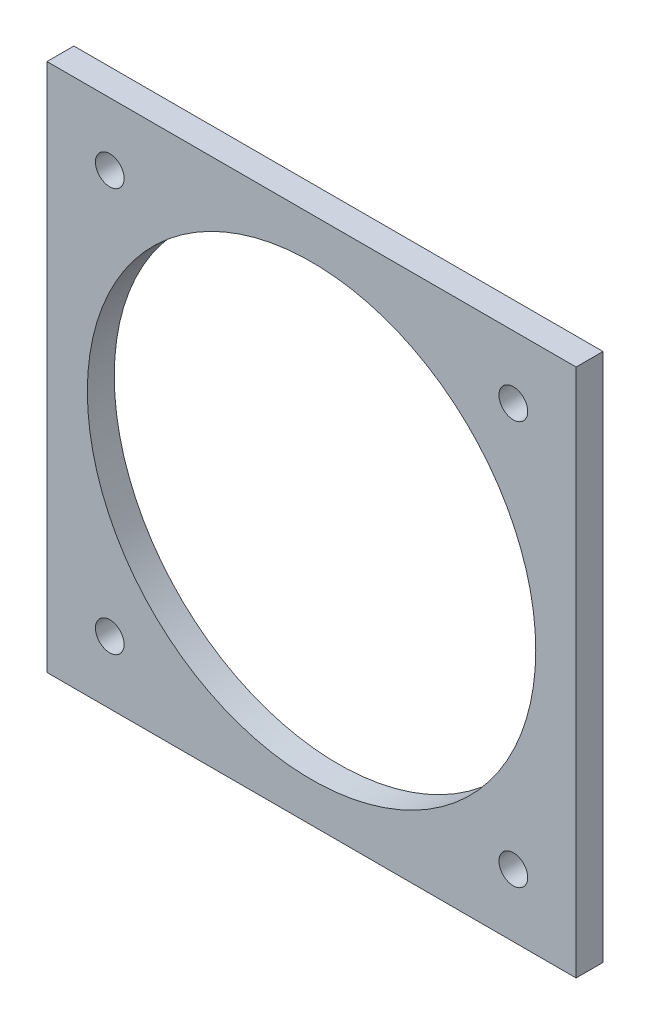
ISO-10303-21;
HEADER;
FILE_DESCRIPTION(('STEP AP214'),'2;1');
FILE_NAME('part.step','',(''),(''),'','','');
FILE_SCHEMA(('AUTOMOTIVE_DESIGN { 1 0 10303 214 1 1 1 1 }'));
ENDSEC;
DATA;
#1=APPLICATION_CONTEXT('core data for automotive mechanical design processes');
#2=APPLICATION_PROTOCOL_DEFINITION('international standard','automotive_design',2000,#1);
#3=PRODUCT_CONTEXT('',#1,'mechanical');
#4=PRODUCT('Part','Part','',(#3));
#5=PRODUCT_RELATED_PRODUCT_CATEGORY('part','',(#4));
#6=PRODUCT_DEFINITION_FORMATION('','',#4);
#7=PRODUCT_DEFINITION_CONTEXT('part definition',#1,'design');
#8=PRODUCT_DEFINITION('design','',#6,#7);
#9=PRODUCT_DEFINITION_SHAPE('','',#8);
#10=(LENGTH_UNIT() NAMED_UNIT(*) SI_UNIT(.MILLI.,.METRE.));
#11=(NAMED_UNIT(*) PLANE_ANGLE_UNIT() SI_UNIT($,.RADIAN.));
#12=(NAMED_UNIT(*) SI_UNIT($,.STERADIAN.) SOLID_ANGLE_UNIT());
#13=UNCERTAINTY_MEASURE_WITH_UNIT(LENGTH_MEASURE(1.E-05),#10,'distance_accuracy_value','');
#14=(GEOMETRIC_REPRESENTATION_CONTEXT(3) GLOBAL_UNCERTAINTY_ASSIGNED_CONTEXT((#13)) GLOBAL_UNIT_ASSIGNED_CONTEXT((#10,
#11,#12)) REPRESENTATION_CONTEXT('',''));
#15=CARTESIAN_POINT('',(0.,0.,0.));
#16=DIRECTION('',(0.,0.,1.));
#17=DIRECTION('',(1.,0.,0.));
#18=AXIS2_PLACEMENT_3D('',#15,#16,#17);
#19=CARTESIAN_POINT('',(0.,0.,3.));
#20=DIRECTION('',(0.,0.,-1.));
#21=DIRECTION('',(-1.,0.,0.));
#22=AXIS2_PLACEMENT_3D('',#19,#20,#21);
#23=PLANE('',#22);
#24=CARTESIAN_POINT('',(7.,7.,3.));
#25=DIRECTION('',(0.,0.,1.));
#26=DIRECTION('',(1.,0.,0.));
#27=AXIS2_PLACEMENT_3D('',#24,#25,#26);
#28=CIRCLE('',#27,1.6);
#29=CARTESIAN_POINT('',(8.6,7.,3.));
#30=VERTEX_POINT('',#29);
#31=EDGE_CURVE('E126',#30,#30,#28,.T.);
#32=ORIENTED_EDGE('',*,*,#31,.F.);
#33=EDGE_LOOP('',(#32));
#34=FACE_BOUND('',#33,.T.);
#35=CARTESIAN_POINT('',(52.,52.,3.));
#36=DIRECTION('',(0.,0.,1.));
#37=DIRECTION('',(1.,0.,0.));
#38=AXIS2_PLACEMENT_3D('',#35,#36,#37);
#39=CIRCLE('',#38,1.6);
#40=CARTESIAN_POINT('',(53.6,52.,3.));
#41=VERTEX_POINT('',#40);
#42=EDGE_CURVE('E114',#41,#41,#39,.T.);
#43=ORIENTED_EDGE('',*,*,#42,.F.);
#44=EDGE_LOOP('',(#43));
#45=FACE_BOUND('',#44,.T.);
#46=DIRECTION('',(0.,-1.,0.));
#47=VECTOR('',#46,1.);
#48=CARTESIAN_POINT('',(0.,0.,3.));
#49=LINE('',#48,#47);
#50=CARTESIAN_POINT('',(0.,59.,3.));
#51=VERTEX_POINT('',#50);
#52=CARTESIAN_POINT('',(0.,0.,3.));
#53=VERTEX_POINT('',#52);
#54=EDGE_CURVE('E84',#51,#53,#49,.T.);
#55=ORIENTED_EDGE('',*,*,#54,.T.);
#56=DIRECTION('',(1.,0.,0.));
#57=VECTOR('',#56,1.);
#58=CARTESIAN_POINT('',(0.,0.,3.));
#59=LINE('',#58,#57);
#60=CARTESIAN_POINT('',(59.,0.,3.));
#61=VERTEX_POINT('',#60);
#62=EDGE_CURVE('E79',#53,#61,#59,.T.);
#63=ORIENTED_EDGE('',*,*,#62,.T.);
#64=DIRECTION('',(0.,1.,0.));
#65=VECTOR('',#64,1.);
#66=CARTESIAN_POINT('',(59.,0.,3.));
#67=LINE('',#66,#65);
#68=CARTESIAN_POINT('',(59.,59.,3.));
#69=VERTEX_POINT('',#68);
#70=EDGE_CURVE('E82',#61,#69,#67,.T.);
#71=ORIENTED_EDGE('',*,*,#70,.T.);
#72=DIRECTION('',(-1.,0.,0.));
#73=VECTOR('',#72,1.);
#74=CARTESIAN_POINT('',(0.,59.,3.));
#75=LINE('',#74,#73);
#76=EDGE_CURVE('E49',#69,#51,#75,.T.);
#77=ORIENTED_EDGE('',*,*,#76,.T.);
#78=EDGE_LOOP('',(#55,#63,#71,#77));
#79=FACE_BOUND('',#78,.T.);
#80=CARTESIAN_POINT('',(7.,52.,3.));
#81=DIRECTION('',(0.,0.,1.));
#82=DIRECTION('',(1.,0.,0.));
#83=AXIS2_PLACEMENT_3D('',#80,#81,#82);
#84=CIRCLE('',#83,1.6);
#85=CARTESIAN_POINT('',(8.6,52.,3.));
#86=VERTEX_POINT('',#85);
#87=EDGE_CURVE('E99',#86,#86,#84,.T.);
#88=ORIENTED_EDGE('',*,*,#87,.F.);
#89=EDGE_LOOP('',(#88));
#90=FACE_BOUND('',#89,.T.);
#91=CARTESIAN_POINT('',(52.,7.,3.));
#92=DIRECTION('',(0.,0.,1.));
#93=DIRECTION('',(1.,0.,0.));
#94=AXIS2_PLACEMENT_3D('',#91,#92,#93);
#95=CIRCLE('',#94,1.6);
#96=CARTESIAN_POINT('',(53.6,7.,3.));
#97=VERTEX_POINT('',#96);
#98=EDGE_CURVE('E120',#97,#97,#95,.T.);
#99=ORIENTED_EDGE('',*,*,#98,.F.);
#100=EDGE_LOOP('',(#99));
#101=FACE_BOUND('',#100,.T.);
#102=CARTESIAN_POINT('',(29.5,29.4,3.));
#103=DIRECTION('',(0.,0.,1.));
#104=DIRECTION('',(1.,0.,0.));
#105=AXIS2_PLACEMENT_3D('',#102,#103,#104);
#106=CIRCLE('',#105,25.);
#107=CARTESIAN_POINT('',(54.5,29.4,3.));
#108=VERTEX_POINT('',#107);
#109=EDGE_CURVE('E132',#108,#108,#106,.T.);
#110=ORIENTED_EDGE('',*,*,#109,.F.);
#111=EDGE_LOOP('',(#110));
#112=FACE_BOUND('',#111,.T.);
#113=ADVANCED_FACE('F32',(#34,#45,#79,#90,#101,#112),#23,.F.);
#114=CARTESIAN_POINT('',(0.,0.,0.));
#115=DIRECTION('',(0.,0.,-1.));
#116=DIRECTION('',(-1.,0.,0.));
#117=AXIS2_PLACEMENT_3D('',#114,#115,#116);
#118=PLANE('',#117);
#119=CARTESIAN_POINT('',(7.,7.,0.));
#120=DIRECTION('',(0.,0.,1.));
#121=DIRECTION('',(1.,0.,0.));
#122=AXIS2_PLACEMENT_3D('',#119,#120,#121);
#123=CIRCLE('',#122,1.6);
#124=CARTESIAN_POINT('',(8.6,7.,0.));
#125=VERTEX_POINT('',#124);
#126=EDGE_CURVE('E129',#125,#125,#123,.T.);
#127=ORIENTED_EDGE('',*,*,#126,.T.);
#128=EDGE_LOOP('',(#127));
#129=FACE_BOUND('',#128,.T.);
#130=CARTESIAN_POINT('',(52.,52.,0.));
#131=DIRECTION('',(0.,0.,1.));
#132=DIRECTION('',(1.,0.,0.));
#133=AXIS2_PLACEMENT_3D('',#130,#131,#132);
#134=CIRCLE('',#133,1.6);
#135=CARTESIAN_POINT('',(53.6,52.,0.));
#136=VERTEX_POINT('',#135);
#137=EDGE_CURVE('E117',#136,#136,#134,.T.);
#138=ORIENTED_EDGE('',*,*,#137,.T.);
#139=EDGE_LOOP('',(#138));
#140=FACE_BOUND('',#139,.T.);
#141=DIRECTION('',(0.,-1.,0.));
#142=VECTOR('',#141,1.);
#143=CARTESIAN_POINT('',(0.,0.,0.));
#144=LINE('',#143,#142);
#145=CARTESIAN_POINT('',(0.,59.,0.));
#146=VERTEX_POINT('',#145);
#147=CARTESIAN_POINT('',(0.,0.,0.));
#148=VERTEX_POINT('',#147);
#149=EDGE_CURVE('E96',#146,#148,#144,.T.);
#150=ORIENTED_EDGE('',*,*,#149,.F.);
#151=DIRECTION('',(-1.,0.,0.));
#152=VECTOR('',#151,1.);
#153=CARTESIAN_POINT('',(0.,59.,0.));
#154=LINE('',#153,#152);
#155=CARTESIAN_POINT('',(59.,59.,0.));
#156=VERTEX_POINT('',#155);
#157=EDGE_CURVE('E72',#156,#146,#154,.T.);
#158=ORIENTED_EDGE('',*,*,#157,.F.);
#159=DIRECTION('',(0.,1.,0.));
#160=VECTOR('',#159,1.);
#161=CARTESIAN_POINT('',(59.,0.,0.));
#162=LINE('',#161,#160);
#163=CARTESIAN_POINT('',(59.,0.,0.));
#164=VERTEX_POINT('',#163);
#165=EDGE_CURVE('E66',#164,#156,#162,.T.);
#166=ORIENTED_EDGE('',*,*,#165,.F.);
#167=DIRECTION('',(1.,0.,0.));
#168=VECTOR('',#167,1.);
#169=CARTESIAN_POINT('',(0.,0.,0.));
#170=LINE('',#169,#168);
#171=EDGE_CURVE('E88',#148,#164,#170,.T.);
#172=ORIENTED_EDGE('',*,*,#171,.F.);
#173=EDGE_LOOP('',(#150,#158,#166,#172));
#174=FACE_BOUND('',#173,.T.);
#175=CARTESIAN_POINT('',(7.,52.,0.));
#176=DIRECTION('',(0.,0.,1.));
#177=DIRECTION('',(1.,0.,0.));
#178=AXIS2_PLACEMENT_3D('',#175,#176,#177);
#179=CIRCLE('',#178,1.6);
#180=CARTESIAN_POINT('',(8.6,52.,0.));
#181=VERTEX_POINT('',#180);
#182=EDGE_CURVE('E111',#181,#181,#179,.T.);
#183=ORIENTED_EDGE('',*,*,#182,.T.);
#184=EDGE_LOOP('',(#183));
#185=FACE_BOUND('',#184,.T.);
#186=CARTESIAN_POINT('',(52.,7.,0.));
#187=DIRECTION('',(0.,0.,1.));
#188=DIRECTION('',(1.,0.,0.));
#189=AXIS2_PLACEMENT_3D('',#186,#187,#188);
#190=CIRCLE('',#189,1.6);
#191=CARTESIAN_POINT('',(53.6,7.,0.));
#192=VERTEX_POINT('',#191);
#193=EDGE_CURVE('E123',#192,#192,#190,.T.);
#194=ORIENTED_EDGE('',*,*,#193,.T.);
#195=EDGE_LOOP('',(#194));
#196=FACE_BOUND('',#195,.T.);
#197=CARTESIAN_POINT('',(29.5,29.4,0.));
#198=DIRECTION('',(0.,0.,1.));
#199=DIRECTION('',(1.,0.,0.));
#200=AXIS2_PLACEMENT_3D('',#197,#198,#199);
#201=CIRCLE('',#200,25.);
#202=CARTESIAN_POINT('',(54.5,29.4,0.));
#203=VERTEX_POINT('',#202);
#204=EDGE_CURVE('E135',#203,#203,#201,.T.);
#205=ORIENTED_EDGE('',*,*,#204,.T.);
#206=EDGE_LOOP('',(#205));
#207=FACE_BOUND('',#206,.T.);
#208=ADVANCED_FACE('F107',(#129,#140,#174,#185,#196,#207),#118,.T.);
#209=CARTESIAN_POINT('',(0.,0.,3.));
#210=DIRECTION('',(1.,0.,0.));
#211=DIRECTION('',(0.,1.,0.));
#212=AXIS2_PLACEMENT_3D('',#209,#210,#211);
#213=PLANE('',#212);
#214=ORIENTED_EDGE('',*,*,#149,.T.);
#215=DIRECTION('',(0.,0.,-1.));
#216=VECTOR('',#215,1.);
#217=CARTESIAN_POINT('',(0.,0.,3.));
#218=LINE('',#217,#216);
#219=EDGE_CURVE('E11',#53,#148,#218,.T.);
#220=ORIENTED_EDGE('',*,*,#219,.F.);
#221=ORIENTED_EDGE('',*,*,#54,.F.);
#222=DIRECTION('',(0.,0.,-1.));
#223=VECTOR('',#222,1.);
#224=CARTESIAN_POINT('',(0.,59.,3.));
#225=LINE('',#224,#223);
#226=EDGE_CURVE('E92',#51,#146,#225,.T.);
#227=ORIENTED_EDGE('',*,*,#226,.T.);
#228=EDGE_LOOP('',(#214,#220,#221,#227));
#229=FACE_BOUND('',#228,.T.);
#230=ADVANCED_FACE('F34',(#229),#213,.F.);
#231=CARTESIAN_POINT('',(0.,0.,3.));
#232=DIRECTION('',(0.,1.,0.));
#233=DIRECTION('',(0.,0.,1.));
#234=AXIS2_PLACEMENT_3D('',#231,#232,#233);
#235=PLANE('',#234);
#236=ORIENTED_EDGE('',*,*,#171,.T.);
#237=DIRECTION('',(0.,0.,-1.));
#238=VECTOR('',#237,1.);
#239=CARTESIAN_POINT('',(59.,0.,3.));
#240=LINE('',#239,#238);
#241=EDGE_CURVE('E41',#61,#164,#240,.T.);
#242=ORIENTED_EDGE('',*,*,#241,.F.);
#243=ORIENTED_EDGE('',*,*,#62,.F.);
#244=ORIENTED_EDGE('',*,*,#219,.T.);
#245=EDGE_LOOP('',(#236,#242,#243,#244));
#246=FACE_BOUND('',#245,.T.);
#247=ADVANCED_FACE('F87',(#246),#235,.F.);
#248=CARTESIAN_POINT('',(59.,0.,3.));
#249=DIRECTION('',(-1.,0.,0.));
#250=DIRECTION('',(0.,-1.,0.));
#251=AXIS2_PLACEMENT_3D('',#248,#249,#250);
#252=PLANE('',#251);
#253=ORIENTED_EDGE('',*,*,#165,.T.);
#254=DIRECTION('',(0.,0.,-1.));
#255=VECTOR('',#254,1.);
#256=CARTESIAN_POINT('',(59.,59.,3.));
#257=LINE('',#256,#255);
#258=EDGE_CURVE('E89',#69,#156,#257,.T.);
#259=ORIENTED_EDGE('',*,*,#258,.F.);
#260=ORIENTED_EDGE('',*,*,#70,.F.);
#261=ORIENTED_EDGE('',*,*,#241,.T.);
#262=EDGE_LOOP('',(#253,#259,#260,#261));
#263=FACE_BOUND('',#262,.T.);
#264=ADVANCED_FACE('F90',(#263),#252,.F.);
#265=CARTESIAN_POINT('',(0.,59.,3.));
#266=DIRECTION('',(0.,-1.,0.));
#267=DIRECTION('',(0.,0.,-1.));
#268=AXIS2_PLACEMENT_3D('',#265,#266,#267);
#269=PLANE('',#268);
#270=ORIENTED_EDGE('',*,*,#157,.T.);
#271=ORIENTED_EDGE('',*,*,#226,.F.);
#272=ORIENTED_EDGE('',*,*,#76,.F.);
#273=ORIENTED_EDGE('',*,*,#258,.T.);
#274=EDGE_LOOP('',(#270,#271,#272,#273));
#275=FACE_BOUND('',#274,.T.);
#276=ADVANCED_FACE('F104',(#275),#269,.F.);
#277=CARTESIAN_POINT('',(7.,52.,3.));
#278=DIRECTION('',(0.,0.,-1.));
#279=DIRECTION('',(-1.,0.,0.));
#280=AXIS2_PLACEMENT_3D('',#277,#278,#279);
#281=CYLINDRICAL_SURFACE('',#280,1.6);
#282=ORIENTED_EDGE('',*,*,#87,.T.);
#283=EDGE_LOOP('',(#282));
#284=FACE_BOUND('',#283,.T.);
#285=ORIENTED_EDGE('',*,*,#182,.F.);
#286=EDGE_LOOP('',(#285));
#287=FACE_BOUND('',#286,.T.);
#288=ADVANCED_FACE('F155',(#284,#287),#281,.F.);
#289=CARTESIAN_POINT('',(52.,52.,3.));
#290=DIRECTION('',(0.,0.,-1.));
#291=DIRECTION('',(-1.,0.,0.));
#292=AXIS2_PLACEMENT_3D('',#289,#290,#291);
#293=CYLINDRICAL_SURFACE('',#292,1.6);
#294=ORIENTED_EDGE('',*,*,#42,.T.);
#295=EDGE_LOOP('',(#294));
#296=FACE_BOUND('',#295,.T.);
#297=ORIENTED_EDGE('',*,*,#137,.F.);
#298=EDGE_LOOP('',(#297));
#299=FACE_BOUND('',#298,.T.);
#300=ADVANCED_FACE('F201',(#296,#299),#293,.F.);
#301=CARTESIAN_POINT('',(52.,7.,3.));
#302=DIRECTION('',(0.,0.,-1.));
#303=DIRECTION('',(-1.,0.,0.));
#304=AXIS2_PLACEMENT_3D('',#301,#302,#303);
#305=CYLINDRICAL_SURFACE('',#304,1.6);
#306=ORIENTED_EDGE('',*,*,#98,.T.);
#307=EDGE_LOOP('',(#306));
#308=FACE_BOUND('',#307,.T.);
#309=ORIENTED_EDGE('',*,*,#193,.F.);
#310=EDGE_LOOP('',(#309));
#311=FACE_BOUND('',#310,.T.);
#312=ADVANCED_FACE('F209',(#308,#311),#305,.F.);
#313=CARTESIAN_POINT('',(7.,7.,3.));
#314=DIRECTION('',(0.,0.,-1.));
#315=DIRECTION('',(-1.,0.,0.));
#316=AXIS2_PLACEMENT_3D('',#313,#314,#315);
#317=CYLINDRICAL_SURFACE('',#316,1.6);
#318=ORIENTED_EDGE('',*,*,#31,.T.);
#319=EDGE_LOOP('',(#318));
#320=FACE_BOUND('',#319,.T.);
#321=ORIENTED_EDGE('',*,*,#126,.F.);
#322=EDGE_LOOP('',(#321));
#323=FACE_BOUND('',#322,.T.);
#324=ADVANCED_FACE('F217',(#320,#323),#317,.F.);
#325=CARTESIAN_POINT('',(29.5,29.4,3.));
#326=DIRECTION('',(0.,0.,-1.));
#327=DIRECTION('',(-1.,0.,0.));
#328=AXIS2_PLACEMENT_3D('',#325,#326,#327);
#329=CYLINDRICAL_SURFACE('',#328,25.);
#330=ORIENTED_EDGE('',*,*,#109,.T.);
#331=EDGE_LOOP('',(#330));
#332=FACE_BOUND('',#331,.T.);
#333=ORIENTED_EDGE('',*,*,#204,.F.);
#334=EDGE_LOOP('',(#333));
#335=FACE_BOUND('',#334,.T.);
#336=ADVANCED_FACE('F141',(#332,#335),#329,.F.);
#337=CLOSED_SHELL('',(#113,#208,#230,#247,#264,#276,#288,#300,#312,#324,#336));
#338=MANIFOLD_SOLID_BREP('B2',#337);
#339=ADVANCED_BREP_SHAPE_REPRESENTATION('',(#18,#338),#14);
#340=SHAPE_DEFINITION_REPRESENTATION(#9,#339);
ENDSEC;
END-ISO-10303-21;
